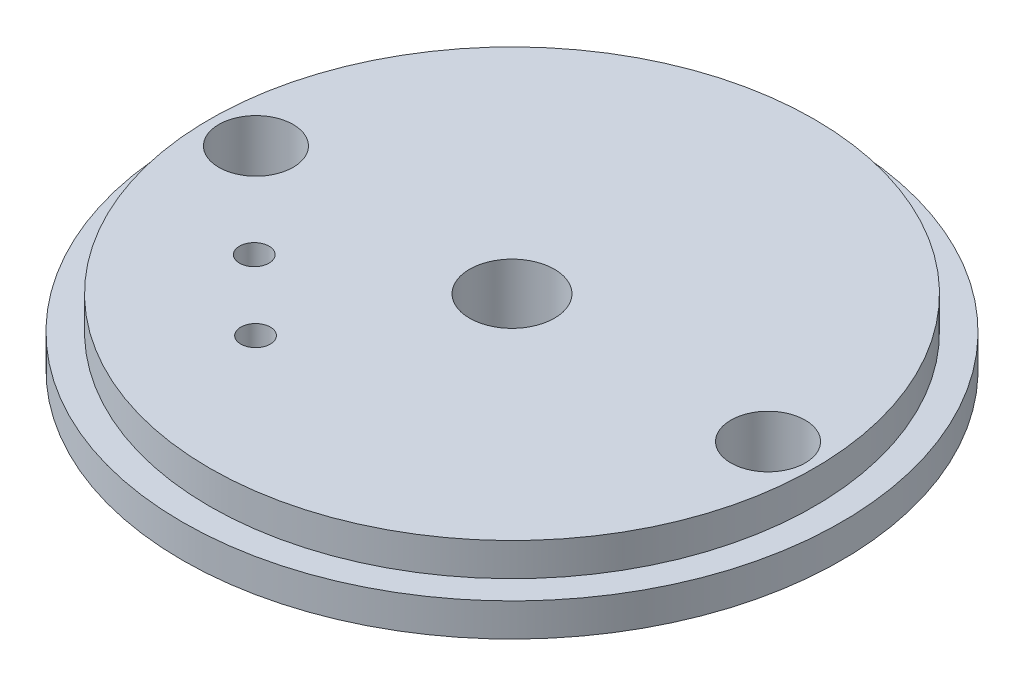
ISO-10303-21;
HEADER;
FILE_DESCRIPTION(('STEP AP214'),'2;1');
FILE_NAME('part.step','',(''),(''),'','','');
FILE_SCHEMA(('AUTOMOTIVE_DESIGN { 1 0 10303 214 1 1 1 1 }'));
ENDSEC;
DATA;
#1=APPLICATION_CONTEXT('core data for automotive mechanical design processes');
#2=APPLICATION_PROTOCOL_DEFINITION('international standard','automotive_design',2000,#1);
#3=PRODUCT_CONTEXT('',#1,'mechanical');
#4=PRODUCT('Part','Part','',(#3));
#5=PRODUCT_RELATED_PRODUCT_CATEGORY('part','',(#4));
#6=PRODUCT_DEFINITION_FORMATION('','',#4);
#7=PRODUCT_DEFINITION_CONTEXT('part definition',#1,'design');
#8=PRODUCT_DEFINITION('design','',#6,#7);
#9=PRODUCT_DEFINITION_SHAPE('','',#8);
#10=(LENGTH_UNIT() NAMED_UNIT(*) SI_UNIT(.MILLI.,.METRE.));
#11=(NAMED_UNIT(*) PLANE_ANGLE_UNIT() SI_UNIT($,.RADIAN.));
#12=(NAMED_UNIT(*) SI_UNIT($,.STERADIAN.) SOLID_ANGLE_UNIT());
#13=UNCERTAINTY_MEASURE_WITH_UNIT(LENGTH_MEASURE(1.E-05),#10,'distance_accuracy_value','');
#14=(GEOMETRIC_REPRESENTATION_CONTEXT(3) GLOBAL_UNCERTAINTY_ASSIGNED_CONTEXT((#13)) GLOBAL_UNIT_ASSIGNED_CONTEXT((#10,
#11,#12)) REPRESENTATION_CONTEXT('',''));
#15=CARTESIAN_POINT('',(0.,0.,0.));
#16=DIRECTION('',(0.,0.,1.));
#17=DIRECTION('',(1.,0.,0.));
#18=AXIS2_PLACEMENT_3D('',#15,#16,#17);
#19=CARTESIAN_POINT('',(0.,2.54,0.));
#20=DIRECTION('',(0.,-1.,0.));
#21=DIRECTION('',(0.,0.,-1.));
#22=AXIS2_PLACEMENT_3D('',#19,#20,#21);
#23=CYLINDRICAL_SURFACE('',#22,25.3365);
#24=CARTESIAN_POINT('',(0.,2.54,0.));
#25=DIRECTION('',(0.,1.,0.));
#26=DIRECTION('',(0.,0.,1.));
#27=AXIS2_PLACEMENT_3D('',#24,#25,#26);
#28=CIRCLE('',#27,25.3365);
#29=CARTESIAN_POINT('',(0.,2.54,25.3365));
#30=VERTEX_POINT('',#29);
#31=EDGE_CURVE('E43',#30,#30,#28,.T.);
#32=ORIENTED_EDGE('',*,*,#31,.F.);
#33=EDGE_LOOP('',(#32));
#34=FACE_BOUND('',#33,.T.);
#35=CARTESIAN_POINT('',(0.,0.,0.));
#36=DIRECTION('',(0.,1.,0.));
#37=DIRECTION('',(0.,0.,1.));
#38=AXIS2_PLACEMENT_3D('',#35,#36,#37);
#39=CIRCLE('',#38,25.3365);
#40=CARTESIAN_POINT('',(0.,0.,25.3365));
#41=VERTEX_POINT('',#40);
#42=EDGE_CURVE('E39',#41,#41,#39,.T.);
#43=ORIENTED_EDGE('',*,*,#42,.T.);
#44=EDGE_LOOP('',(#43));
#45=FACE_BOUND('',#44,.T.);
#46=ADVANCED_FACE('F36',(#34,#45),#23,.T.);
#47=CARTESIAN_POINT('',(0.,2.54,0.));
#48=DIRECTION('',(0.,1.,0.));
#49=DIRECTION('',(0.,0.,1.));
#50=AXIS2_PLACEMENT_3D('',#47,#48,#49);
#51=PLANE('',#50);
#52=CARTESIAN_POINT('',(0.,2.54,0.));
#53=DIRECTION('',(0.,1.,0.));
#54=DIRECTION('',(0.,0.,1.));
#55=AXIS2_PLACEMENT_3D('',#52,#53,#54);
#56=CIRCLE('',#55,23.241);
#57=CARTESIAN_POINT('',(0.,2.54,23.241));
#58=VERTEX_POINT('',#57);
#59=EDGE_CURVE('E10',#58,#58,#56,.T.);
#60=ORIENTED_EDGE('',*,*,#59,.F.);
#61=EDGE_LOOP('',(#60));
#62=FACE_BOUND('',#61,.T.);
#63=ORIENTED_EDGE('',*,*,#31,.T.);
#64=EDGE_LOOP('',(#63));
#65=FACE_BOUND('',#64,.T.);
#66=ADVANCED_FACE('F89',(#62,#65),#51,.T.);
#67=CARTESIAN_POINT('',(0.,0.,0.));
#68=DIRECTION('',(0.,1.,0.));
#69=DIRECTION('',(0.,0.,1.));
#70=AXIS2_PLACEMENT_3D('',#67,#68,#69);
#71=PLANE('',#70);
#72=CARTESIAN_POINT('',(-7.06988515400752,0.,12.6437214976351));
#73=DIRECTION('',(0.,-1.,0.));
#74=DIRECTION('',(0.,0.,-1.));
#75=AXIS2_PLACEMENT_3D('',#72,#73,#74);
#76=CIRCLE('',#75,1.13638204624117);
#77=CARTESIAN_POINT('',(-7.06988515400752,0.,11.5073394513939));
#78=VERTEX_POINT('',#77);
#79=EDGE_CURVE('E63',#78,#78,#76,.T.);
#80=ORIENTED_EDGE('',*,*,#79,.F.);
#81=EDGE_LOOP('',(#80));
#82=FACE_BOUND('',#81,.T.);
#83=CARTESIAN_POINT('',(-12.5084841195493,0.,7.3064898845225));
#84=DIRECTION('',(0.,-1.,0.));
#85=DIRECTION('',(0.,0.,-1.));
#86=AXIS2_PLACEMENT_3D('',#83,#84,#85);
#87=CIRCLE('',#86,1.13638204624117);
#88=CARTESIAN_POINT('',(-12.5084841195493,0.,6.17010783828133));
#89=VERTEX_POINT('',#88);
#90=EDGE_CURVE('E71',#89,#89,#87,.T.);
#91=ORIENTED_EDGE('',*,*,#90,.F.);
#92=EDGE_LOOP('',(#91));
#93=FACE_BOUND('',#92,.T.);
#94=CARTESIAN_POINT('',(-19.685,0.,0.));
#95=DIRECTION('',(0.,-1.,0.));
#96=DIRECTION('',(0.,0.,-1.));
#97=AXIS2_PLACEMENT_3D('',#94,#95,#96);
#98=CIRCLE('',#97,2.8575);
#99=CARTESIAN_POINT('',(-19.685,0.,-2.8575));
#100=VERTEX_POINT('',#99);
#101=EDGE_CURVE('E58',#100,#100,#98,.T.);
#102=ORIENTED_EDGE('',*,*,#101,.F.);
#103=EDGE_LOOP('',(#102));
#104=FACE_BOUND('',#103,.T.);
#105=CARTESIAN_POINT('',(19.685,0.,0.));
#106=DIRECTION('',(0.,-1.,0.));
#107=DIRECTION('',(0.,0.,-1.));
#108=AXIS2_PLACEMENT_3D('',#105,#106,#107);
#109=CIRCLE('',#108,2.8575);
#110=CARTESIAN_POINT('',(19.685,0.,-2.8575));
#111=VERTEX_POINT('',#110);
#112=EDGE_CURVE('E59',#111,#111,#109,.T.);
#113=ORIENTED_EDGE('',*,*,#112,.F.);
#114=EDGE_LOOP('',(#113));
#115=FACE_BOUND('',#114,.T.);
#116=CARTESIAN_POINT('',(0.,0.,0.));
#117=DIRECTION('',(0.,-1.,0.));
#118=DIRECTION('',(0.,0.,-1.));
#119=AXIS2_PLACEMENT_3D('',#116,#117,#118);
#120=CIRCLE('',#119,3.2639);
#121=CARTESIAN_POINT('',(0.,0.,-3.2639));
#122=VERTEX_POINT('',#121);
#123=EDGE_CURVE('E55',#122,#122,#120,.T.);
#124=ORIENTED_EDGE('',*,*,#123,.F.);
#125=EDGE_LOOP('',(#124));
#126=FACE_BOUND('',#125,.T.);
#127=ORIENTED_EDGE('',*,*,#42,.F.);
#128=EDGE_LOOP('',(#127));
#129=FACE_BOUND('',#128,.T.);
#130=ADVANCED_FACE('F85',(#82,#93,#104,#115,#126,#129),#71,.F.);
#131=CARTESIAN_POINT('',(0.,5.08,0.));
#132=DIRECTION('',(0.,-1.,0.));
#133=DIRECTION('',(0.,0.,-1.));
#134=AXIS2_PLACEMENT_3D('',#131,#132,#133);
#135=CYLINDRICAL_SURFACE('',#134,23.241);
#136=CARTESIAN_POINT('',(0.,5.08,0.));
#137=DIRECTION('',(0.,1.,0.));
#138=DIRECTION('',(0.,0.,1.));
#139=AXIS2_PLACEMENT_3D('',#136,#137,#138);
#140=CIRCLE('',#139,23.241);
#141=CARTESIAN_POINT('',(0.,5.08,23.241));
#142=VERTEX_POINT('',#141);
#143=EDGE_CURVE('E49',#142,#142,#140,.T.);
#144=ORIENTED_EDGE('',*,*,#143,.F.);
#145=EDGE_LOOP('',(#144));
#146=FACE_BOUND('',#145,.T.);
#147=ORIENTED_EDGE('',*,*,#59,.T.);
#148=EDGE_LOOP('',(#147));
#149=FACE_BOUND('',#148,.T.);
#150=ADVANCED_FACE('F88',(#146,#149),#135,.T.);
#151=CARTESIAN_POINT('',(0.,5.08,0.));
#152=DIRECTION('',(0.,1.,0.));
#153=DIRECTION('',(0.,0.,1.));
#154=AXIS2_PLACEMENT_3D('',#151,#152,#153);
#155=PLANE('',#154);
#156=CARTESIAN_POINT('',(-7.06988515400752,5.08,12.6437214976351));
#157=DIRECTION('',(0.,1.,0.));
#158=DIRECTION('',(0.,0.,1.));
#159=AXIS2_PLACEMENT_3D('',#156,#157,#158);
#160=CIRCLE('',#159,1.13638204624117);
#161=CARTESIAN_POINT('',(-7.06988515400752,5.08,13.7801035438762));
#162=VERTEX_POINT('',#161);
#163=EDGE_CURVE('E77',#162,#162,#160,.F.);
#164=ORIENTED_EDGE('',*,*,#163,.T.);
#165=EDGE_LOOP('',(#164));
#166=FACE_BOUND('',#165,.T.);
#167=CARTESIAN_POINT('',(-12.5084841195493,5.08,7.3064898845225));
#168=DIRECTION('',(0.,1.,0.));
#169=DIRECTION('',(0.,0.,1.));
#170=AXIS2_PLACEMENT_3D('',#167,#168,#169);
#171=CIRCLE('',#170,1.13638204624117);
#172=CARTESIAN_POINT('',(-12.5084841195493,5.08,8.44287193076367));
#173=VERTEX_POINT('',#172);
#174=EDGE_CURVE('E74',#173,#173,#171,.F.);
#175=ORIENTED_EDGE('',*,*,#174,.T.);
#176=EDGE_LOOP('',(#175));
#177=FACE_BOUND('',#176,.T.);
#178=CARTESIAN_POINT('',(-19.685,5.08,0.));
#179=DIRECTION('',(0.,1.,0.));
#180=DIRECTION('',(0.,0.,1.));
#181=AXIS2_PLACEMENT_3D('',#178,#179,#180);
#182=CIRCLE('',#181,2.8575);
#183=CARTESIAN_POINT('',(-19.685,5.08,2.8575));
#184=VERTEX_POINT('',#183);
#185=EDGE_CURVE('E66',#184,#184,#182,.F.);
#186=ORIENTED_EDGE('',*,*,#185,.T.);
#187=EDGE_LOOP('',(#186));
#188=FACE_BOUND('',#187,.T.);
#189=CARTESIAN_POINT('',(19.685,5.08,0.));
#190=DIRECTION('',(0.,1.,0.));
#191=DIRECTION('',(0.,0.,1.));
#192=AXIS2_PLACEMENT_3D('',#189,#190,#191);
#193=CIRCLE('',#192,2.8575);
#194=CARTESIAN_POINT('',(19.685,5.08,2.8575));
#195=VERTEX_POINT('',#194);
#196=EDGE_CURVE('E62',#195,#195,#193,.F.);
#197=ORIENTED_EDGE('',*,*,#196,.T.);
#198=EDGE_LOOP('',(#197));
#199=FACE_BOUND('',#198,.T.);
#200=CARTESIAN_POINT('',(0.,5.08,0.));
#201=DIRECTION('',(0.,1.,0.));
#202=DIRECTION('',(0.,0.,1.));
#203=AXIS2_PLACEMENT_3D('',#200,#201,#202);
#204=CIRCLE('',#203,3.2639);
#205=CARTESIAN_POINT('',(0.,5.08,3.2639));
#206=VERTEX_POINT('',#205);
#207=EDGE_CURVE('E52',#206,#206,#204,.T.);
#208=ORIENTED_EDGE('',*,*,#207,.F.);
#209=EDGE_LOOP('',(#208));
#210=FACE_BOUND('',#209,.T.);
#211=ORIENTED_EDGE('',*,*,#143,.T.);
#212=EDGE_LOOP('',(#211));
#213=FACE_BOUND('',#212,.T.);
#214=ADVANCED_FACE('F115',(#166,#177,#188,#199,#210,#213),#155,.T.);
#215=CARTESIAN_POINT('',(0.,0.,0.));
#216=DIRECTION('',(0.,-1.,0.));
#217=DIRECTION('',(0.,0.,-1.));
#218=AXIS2_PLACEMENT_3D('',#215,#216,#217);
#219=CYLINDRICAL_SURFACE('',#218,3.2639);
#220=ORIENTED_EDGE('',*,*,#123,.T.);
#221=EDGE_LOOP('',(#220));
#222=FACE_BOUND('',#221,.T.);
#223=ORIENTED_EDGE('',*,*,#207,.T.);
#224=EDGE_LOOP('',(#223));
#225=FACE_BOUND('',#224,.T.);
#226=ADVANCED_FACE('F119',(#222,#225),#219,.F.);
#227=CARTESIAN_POINT('',(19.685,5.081,0.));
#228=DIRECTION('',(0.,-1.,0.));
#229=DIRECTION('',(0.,0.,-1.));
#230=AXIS2_PLACEMENT_3D('',#227,#228,#229);
#231=CYLINDRICAL_SURFACE('',#230,2.8575);
#232=ORIENTED_EDGE('',*,*,#196,.F.);
#233=EDGE_LOOP('',(#232));
#234=FACE_BOUND('',#233,.T.);
#235=ORIENTED_EDGE('',*,*,#112,.T.);
#236=EDGE_LOOP('',(#235));
#237=FACE_BOUND('',#236,.T.);
#238=ADVANCED_FACE('F123',(#234,#237),#231,.F.);
#239=CARTESIAN_POINT('',(-19.685,5.081,0.));
#240=DIRECTION('',(0.,-1.,0.));
#241=DIRECTION('',(0.,0.,-1.));
#242=AXIS2_PLACEMENT_3D('',#239,#240,#241);
#243=CYLINDRICAL_SURFACE('',#242,2.8575);
#244=ORIENTED_EDGE('',*,*,#185,.F.);
#245=EDGE_LOOP('',(#244));
#246=FACE_BOUND('',#245,.T.);
#247=ORIENTED_EDGE('',*,*,#101,.T.);
#248=EDGE_LOOP('',(#247));
#249=FACE_BOUND('',#248,.T.);
#250=ADVANCED_FACE('F127',(#246,#249),#243,.F.);
#251=CARTESIAN_POINT('',(-12.5084841195493,5.081,7.3064898845225));
#252=DIRECTION('',(0.,-1.,0.));
#253=DIRECTION('',(0.,0.,-1.));
#254=AXIS2_PLACEMENT_3D('',#251,#252,#253);
#255=CYLINDRICAL_SURFACE('',#254,1.13638204624117);
#256=ORIENTED_EDGE('',*,*,#174,.F.);
#257=EDGE_LOOP('',(#256));
#258=FACE_BOUND('',#257,.T.);
#259=ORIENTED_EDGE('',*,*,#90,.T.);
#260=EDGE_LOOP('',(#259));
#261=FACE_BOUND('',#260,.T.);
#262=ADVANCED_FACE('F131',(#258,#261),#255,.F.);
#263=CARTESIAN_POINT('',(-7.06988515400752,5.081,12.6437214976351));
#264=DIRECTION('',(0.,-1.,0.));
#265=DIRECTION('',(0.,0.,-1.));
#266=AXIS2_PLACEMENT_3D('',#263,#264,#265);
#267=CYLINDRICAL_SURFACE('',#266,1.13638204624117);
#268=ORIENTED_EDGE('',*,*,#163,.F.);
#269=EDGE_LOOP('',(#268));
#270=FACE_BOUND('',#269,.T.);
#271=ORIENTED_EDGE('',*,*,#79,.T.);
#272=EDGE_LOOP('',(#271));
#273=FACE_BOUND('',#272,.T.);
#274=ADVANCED_FACE('F83',(#270,#273),#267,.F.);
#275=CLOSED_SHELL('',(#46,#66,#130,#150,#214,#226,#238,#250,#262,#274));
#276=MANIFOLD_SOLID_BREP('B2',#275);
#277=ADVANCED_BREP_SHAPE_REPRESENTATION('',(#18,#276),#14);
#278=SHAPE_DEFINITION_REPRESENTATION(#9,#277);
ENDSEC;
END-ISO-10303-21;
